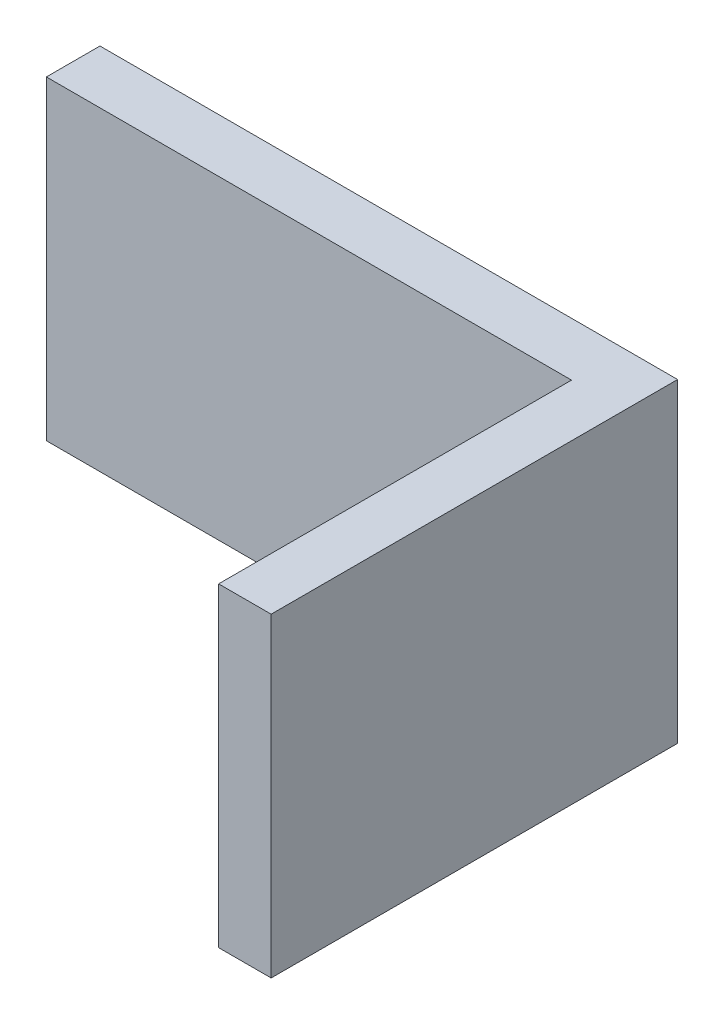
ISO-10303-21;
HEADER;
FILE_DESCRIPTION(('STEP AP214'),'2;1');
FILE_NAME('part.step','',(''),(''),'','','');
FILE_SCHEMA(('AUTOMOTIVE_DESIGN { 1 0 10303 214 1 1 1 1 }'));
ENDSEC;
DATA;
#1=APPLICATION_CONTEXT('core data for automotive mechanical design processes');
#2=APPLICATION_PROTOCOL_DEFINITION('international standard','automotive_design',2000,#1);
#3=PRODUCT_CONTEXT('',#1,'mechanical');
#4=PRODUCT('Part','Part','',(#3));
#5=PRODUCT_RELATED_PRODUCT_CATEGORY('part','',(#4));
#6=PRODUCT_DEFINITION_FORMATION('','',#4);
#7=PRODUCT_DEFINITION_CONTEXT('part definition',#1,'design');
#8=PRODUCT_DEFINITION('design','',#6,#7);
#9=PRODUCT_DEFINITION_SHAPE('','',#8);
#10=(LENGTH_UNIT() NAMED_UNIT(*) SI_UNIT(.MILLI.,.METRE.));
#11=(NAMED_UNIT(*) PLANE_ANGLE_UNIT() SI_UNIT($,.RADIAN.));
#12=(NAMED_UNIT(*) SI_UNIT($,.STERADIAN.) SOLID_ANGLE_UNIT());
#13=UNCERTAINTY_MEASURE_WITH_UNIT(LENGTH_MEASURE(1.E-05),#10,'distance_accuracy_value','');
#14=(GEOMETRIC_REPRESENTATION_CONTEXT(3) GLOBAL_UNCERTAINTY_ASSIGNED_CONTEXT((#13)) GLOBAL_UNIT_ASSIGNED_CONTEXT((#10,
#11,#12)) REPRESENTATION_CONTEXT('',''));
#15=CARTESIAN_POINT('',(0.,0.,0.));
#16=DIRECTION('',(0.,0.,1.));
#17=DIRECTION('',(1.,0.,0.));
#18=AXIS2_PLACEMENT_3D('',#15,#16,#17);
#19=CARTESIAN_POINT('',(4.55,0.4,0.));
#20=DIRECTION('',(0.,1.,0.));
#21=DIRECTION('',(0.,0.,1.));
#22=AXIS2_PLACEMENT_3D('',#19,#20,#21);
#23=PLANE('',#22);
#24=DIRECTION('',(1.,0.,0.));
#25=VECTOR('',#24,1.);
#26=CARTESIAN_POINT('',(4.,0.4,0.));
#27=LINE('',#26,#25);
#28=CARTESIAN_POINT('',(4.,0.4,0.));
#29=VERTEX_POINT('',#28);
#30=CARTESIAN_POINT('',(4.55,0.4,0.));
#31=VERTEX_POINT('',#30);
#32=EDGE_CURVE('E11',#29,#31,#27,.T.);
#33=ORIENTED_EDGE('',*,*,#32,.F.);
#34=DIRECTION('',(0.,0.,-1.));
#35=VECTOR('',#34,1.);
#36=CARTESIAN_POINT('',(4.,0.4,0.051));
#37=LINE('',#36,#35);
#38=CARTESIAN_POINT('',(4.,0.4,0.051));
#39=VERTEX_POINT('',#38);
#40=EDGE_CURVE('E24',#39,#29,#37,.T.);
#41=ORIENTED_EDGE('',*,*,#40,.F.);
#42=DIRECTION('',(-1.,0.,0.));
#43=VECTOR('',#42,1.);
#44=CARTESIAN_POINT('',(4.5,0.4,0.051));
#45=LINE('',#44,#43);
#46=CARTESIAN_POINT('',(4.5,0.4,0.051));
#47=VERTEX_POINT('',#46);
#48=EDGE_CURVE('E87',#47,#39,#45,.T.);
#49=ORIENTED_EDGE('',*,*,#48,.F.);
#50=DIRECTION('',(0.,0.,-1.));
#51=VECTOR('',#50,1.);
#52=CARTESIAN_POINT('',(4.5,0.4,0.387));
#53=LINE('',#52,#51);
#54=CARTESIAN_POINT('',(4.5,0.4,0.387));
#55=VERTEX_POINT('',#54);
#56=EDGE_CURVE('E114',#55,#47,#53,.T.);
#57=ORIENTED_EDGE('',*,*,#56,.F.);
#58=DIRECTION('',(-1.,0.,0.));
#59=VECTOR('',#58,1.);
#60=CARTESIAN_POINT('',(4.55,0.4,0.387));
#61=LINE('',#60,#59);
#62=CARTESIAN_POINT('',(4.55,0.4,0.387));
#63=VERTEX_POINT('',#62);
#64=EDGE_CURVE('E111',#63,#55,#61,.T.);
#65=ORIENTED_EDGE('',*,*,#64,.F.);
#66=DIRECTION('',(0.,0.,1.));
#67=VECTOR('',#66,1.);
#68=CARTESIAN_POINT('',(4.55,0.4,0.));
#69=LINE('',#68,#67);
#70=EDGE_CURVE('E108',#31,#63,#69,.T.);
#71=ORIENTED_EDGE('',*,*,#70,.F.);
#72=EDGE_LOOP('',(#33,#41,#49,#57,#65,#71));
#73=FACE_BOUND('',#72,.T.);
#74=ADVANCED_FACE('F17',(#73),#23,.T.);
#75=CARTESIAN_POINT('',(4.,0.1,0.));
#76=DIRECTION('',(0.,-1.,0.));
#77=DIRECTION('',(0.,0.,1.));
#78=AXIS2_PLACEMENT_3D('',#75,#76,#77);
#79=PLANE('',#78);
#80=DIRECTION('',(-1.,0.,0.));
#81=VECTOR('',#80,1.);
#82=CARTESIAN_POINT('',(4.55,0.1,0.));
#83=LINE('',#82,#81);
#84=CARTESIAN_POINT('',(4.55,0.1,0.));
#85=VERTEX_POINT('',#84);
#86=CARTESIAN_POINT('',(4.,0.1,0.));
#87=VERTEX_POINT('',#86);
#88=EDGE_CURVE('E106',#85,#87,#83,.T.);
#89=ORIENTED_EDGE('',*,*,#88,.F.);
#90=DIRECTION('',(0.,0.,-1.));
#91=VECTOR('',#90,1.);
#92=CARTESIAN_POINT('',(4.55,0.1,0.387));
#93=LINE('',#92,#91);
#94=CARTESIAN_POINT('',(4.55,0.1,0.387));
#95=VERTEX_POINT('',#94);
#96=EDGE_CURVE('E103',#95,#85,#93,.T.);
#97=ORIENTED_EDGE('',*,*,#96,.F.);
#98=DIRECTION('',(1.,0.,0.));
#99=VECTOR('',#98,1.);
#100=CARTESIAN_POINT('',(4.5,0.1,0.387));
#101=LINE('',#100,#99);
#102=CARTESIAN_POINT('',(4.5,0.1,0.387));
#103=VERTEX_POINT('',#102);
#104=EDGE_CURVE('E100',#103,#95,#101,.T.);
#105=ORIENTED_EDGE('',*,*,#104,.F.);
#106=DIRECTION('',(0.,0.,1.));
#107=VECTOR('',#106,1.);
#108=CARTESIAN_POINT('',(4.5,0.1,0.051));
#109=LINE('',#108,#107);
#110=CARTESIAN_POINT('',(4.5,0.1,0.051));
#111=VERTEX_POINT('',#110);
#112=EDGE_CURVE('E72',#111,#103,#109,.T.);
#113=ORIENTED_EDGE('',*,*,#112,.F.);
#114=DIRECTION('',(1.,0.,0.));
#115=VECTOR('',#114,1.);
#116=CARTESIAN_POINT('',(4.,0.1,0.051));
#117=LINE('',#116,#115);
#118=CARTESIAN_POINT('',(4.,0.1,0.051));
#119=VERTEX_POINT('',#118);
#120=EDGE_CURVE('E66',#119,#111,#117,.T.);
#121=ORIENTED_EDGE('',*,*,#120,.F.);
#122=DIRECTION('',(0.,0.,1.));
#123=VECTOR('',#122,1.);
#124=CARTESIAN_POINT('',(4.,0.1,0.));
#125=LINE('',#124,#123);
#126=EDGE_CURVE('E69',#87,#119,#125,.T.);
#127=ORIENTED_EDGE('',*,*,#126,.F.);
#128=EDGE_LOOP('',(#89,#97,#105,#113,#121,#127));
#129=FACE_BOUND('',#128,.T.);
#130=ADVANCED_FACE('F68',(#129),#79,.T.);
#131=CARTESIAN_POINT('',(4.55,0.4,0.387));
#132=DIRECTION('',(0.,0.,1.));
#133=DIRECTION('',(0.,1.,0.));
#134=AXIS2_PLACEMENT_3D('',#131,#132,#133);
#135=PLANE('',#134);
#136=ORIENTED_EDGE('',*,*,#64,.T.);
#137=DIRECTION('',(0.,1.,0.));
#138=VECTOR('',#137,1.);
#139=CARTESIAN_POINT('',(4.5,0.1,0.387));
#140=LINE('',#139,#138);
#141=EDGE_CURVE('E83',#103,#55,#140,.T.);
#142=ORIENTED_EDGE('',*,*,#141,.F.);
#143=ORIENTED_EDGE('',*,*,#104,.T.);
#144=DIRECTION('',(0.,-1.,0.));
#145=VECTOR('',#144,1.);
#146=CARTESIAN_POINT('',(4.55,0.4,0.387));
#147=LINE('',#146,#145);
#148=EDGE_CURVE('E88',#63,#95,#147,.T.);
#149=ORIENTED_EDGE('',*,*,#148,.F.);
#150=EDGE_LOOP('',(#136,#142,#143,#149));
#151=FACE_BOUND('',#150,.T.);
#152=ADVANCED_FACE('F125',(#151),#135,.T.);
#153=CARTESIAN_POINT('',(4.5,0.4,0.051));
#154=DIRECTION('',(0.,0.,1.));
#155=DIRECTION('',(0.,1.,0.));
#156=AXIS2_PLACEMENT_3D('',#153,#154,#155);
#157=PLANE('',#156);
#158=ORIENTED_EDGE('',*,*,#48,.T.);
#159=DIRECTION('',(0.,1.,0.));
#160=VECTOR('',#159,1.);
#161=CARTESIAN_POINT('',(4.,0.1,0.051));
#162=LINE('',#161,#160);
#163=EDGE_CURVE('E81',#119,#39,#162,.T.);
#164=ORIENTED_EDGE('',*,*,#163,.F.);
#165=ORIENTED_EDGE('',*,*,#120,.T.);
#166=DIRECTION('',(0.,-1.,0.));
#167=VECTOR('',#166,1.);
#168=CARTESIAN_POINT('',(4.5,0.4,0.051));
#169=LINE('',#168,#167);
#170=EDGE_CURVE('E89',#47,#111,#169,.T.);
#171=ORIENTED_EDGE('',*,*,#170,.F.);
#172=EDGE_LOOP('',(#158,#164,#165,#171));
#173=FACE_BOUND('',#172,.T.);
#174=ADVANCED_FACE('F86',(#173),#157,.T.);
#175=CARTESIAN_POINT('',(4.55,0.1,0.));
#176=DIRECTION('',(1.,0.,0.));
#177=DIRECTION('',(0.,0.,1.));
#178=AXIS2_PLACEMENT_3D('',#175,#176,#177);
#179=PLANE('',#178);
#180=DIRECTION('',(0.,-1.,0.));
#181=VECTOR('',#180,1.);
#182=CARTESIAN_POINT('',(4.55,0.4,0.));
#183=LINE('',#182,#181);
#184=EDGE_CURVE('E93',#31,#85,#183,.T.);
#185=ORIENTED_EDGE('',*,*,#184,.F.);
#186=ORIENTED_EDGE('',*,*,#70,.T.);
#187=ORIENTED_EDGE('',*,*,#148,.T.);
#188=ORIENTED_EDGE('',*,*,#96,.T.);
#189=EDGE_LOOP('',(#185,#186,#187,#188));
#190=FACE_BOUND('',#189,.T.);
#191=ADVANCED_FACE('F121',(#190),#179,.T.);
#192=CARTESIAN_POINT('',(4.,0.4,0.));
#193=DIRECTION('',(-1.,0.,0.));
#194=DIRECTION('',(0.,0.,1.));
#195=AXIS2_PLACEMENT_3D('',#192,#193,#194);
#196=PLANE('',#195);
#197=DIRECTION('',(0.,1.,0.));
#198=VECTOR('',#197,1.);
#199=CARTESIAN_POINT('',(4.,0.1,0.));
#200=LINE('',#199,#198);
#201=EDGE_CURVE('E82',#87,#29,#200,.T.);
#202=ORIENTED_EDGE('',*,*,#201,.F.);
#203=ORIENTED_EDGE('',*,*,#126,.T.);
#204=ORIENTED_EDGE('',*,*,#163,.T.);
#205=ORIENTED_EDGE('',*,*,#40,.T.);
#206=EDGE_LOOP('',(#202,#203,#204,#205));
#207=FACE_BOUND('',#206,.T.);
#208=ADVANCED_FACE('F80',(#207),#196,.T.);
#209=CARTESIAN_POINT('',(4.5,0.4,0.051));
#210=DIRECTION('',(-1.,0.,0.));
#211=DIRECTION('',(0.,0.,1.));
#212=AXIS2_PLACEMENT_3D('',#209,#210,#211);
#213=PLANE('',#212);
#214=ORIENTED_EDGE('',*,*,#170,.T.);
#215=ORIENTED_EDGE('',*,*,#112,.T.);
#216=ORIENTED_EDGE('',*,*,#141,.T.);
#217=ORIENTED_EDGE('',*,*,#56,.T.);
#218=EDGE_LOOP('',(#214,#215,#216,#217));
#219=FACE_BOUND('',#218,.T.);
#220=ADVANCED_FACE('F127',(#219),#213,.T.);
#221=CARTESIAN_POINT('',(4.55,0.1,0.));
#222=DIRECTION('',(0.,0.,-1.));
#223=DIRECTION('',(0.,1.,0.));
#224=AXIS2_PLACEMENT_3D('',#221,#222,#223);
#225=PLANE('',#224);
#226=ORIENTED_EDGE('',*,*,#88,.T.);
#227=ORIENTED_EDGE('',*,*,#201,.T.);
#228=ORIENTED_EDGE('',*,*,#32,.T.);
#229=ORIENTED_EDGE('',*,*,#184,.T.);
#230=EDGE_LOOP('',(#226,#227,#228,#229));
#231=FACE_BOUND('',#230,.T.);
#232=ADVANCED_FACE('F117',(#231),#225,.T.);
#233=CLOSED_SHELL('',(#74,#130,#152,#174,#191,#208,#220,#232));
#234=MANIFOLD_SOLID_BREP('B1',#233);
#235=ADVANCED_BREP_SHAPE_REPRESENTATION('',(#18,#234),#14);
#236=SHAPE_DEFINITION_REPRESENTATION(#9,#235);
ENDSEC;
END-ISO-10303-21;
